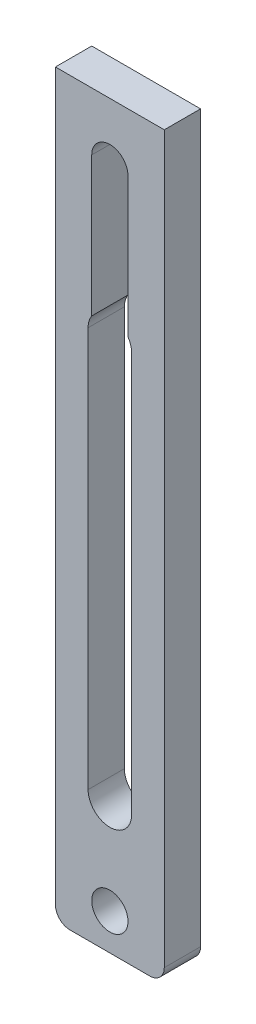
ISO-10303-21;
HEADER;
FILE_DESCRIPTION(('STEP AP214'),'2;1');
FILE_NAME('part.step','',(''),(''),'','','');
FILE_SCHEMA(('AUTOMOTIVE_DESIGN { 1 0 10303 214 1 1 1 1 }'));
ENDSEC;
DATA;
#1=APPLICATION_CONTEXT('core data for automotive mechanical design processes');
#2=APPLICATION_PROTOCOL_DEFINITION('international standard','automotive_design',2000,#1);
#3=PRODUCT_CONTEXT('',#1,'mechanical');
#4=PRODUCT('Part','Part','',(#3));
#5=PRODUCT_RELATED_PRODUCT_CATEGORY('part','',(#4));
#6=PRODUCT_DEFINITION_FORMATION('','',#4);
#7=PRODUCT_DEFINITION_CONTEXT('part definition',#1,'design');
#8=PRODUCT_DEFINITION('design','',#6,#7);
#9=PRODUCT_DEFINITION_SHAPE('','',#8);
#10=(LENGTH_UNIT() NAMED_UNIT(*) SI_UNIT(.MILLI.,.METRE.));
#11=(NAMED_UNIT(*) PLANE_ANGLE_UNIT() SI_UNIT($,.RADIAN.));
#12=(NAMED_UNIT(*) SI_UNIT($,.STERADIAN.) SOLID_ANGLE_UNIT());
#13=UNCERTAINTY_MEASURE_WITH_UNIT(LENGTH_MEASURE(1.E-05),#10,'distance_accuracy_value','');
#14=(GEOMETRIC_REPRESENTATION_CONTEXT(3) GLOBAL_UNCERTAINTY_ASSIGNED_CONTEXT((#13)) GLOBAL_UNIT_ASSIGNED_CONTEXT((#10,
#11,#12)) REPRESENTATION_CONTEXT('',''));
#15=CARTESIAN_POINT('',(0.,0.,0.));
#16=DIRECTION('',(0.,0.,1.));
#17=DIRECTION('',(1.,0.,0.));
#18=AXIS2_PLACEMENT_3D('',#15,#16,#17);
#19=CARTESIAN_POINT('',(-6.985,-62.23,6.35));
#20=DIRECTION('',(0.,0.,-1.));
#21=DIRECTION('',(-1.,0.,0.));
#22=AXIS2_PLACEMENT_3D('',#19,#20,#21);
#23=PLANE('',#22);
#24=DIRECTION('',(0.,1.,0.));
#25=VECTOR('',#24,1.);
#26=CARTESIAN_POINT('',(3.175,-41.91,6.35));
#27=LINE('',#26,#25);
#28=CARTESIAN_POINT('',(3.175,30.2041910980616,6.35));
#29=VERTEX_POINT('',#28);
#30=CARTESIAN_POINT('',(3.175,54.61,6.35));
#31=VERTEX_POINT('',#30);
#32=EDGE_CURVE('E210',#29,#31,#27,.T.);
#33=ORIENTED_EDGE('',*,*,#32,.F.);
#34=CARTESIAN_POINT('',(0.,28.0981343561859,6.35));
#35=DIRECTION('',(0.,0.,1.));
#36=DIRECTION('',(1.,0.,0.));
#37=AXIS2_PLACEMENT_3D('',#34,#35,#36);
#38=CIRCLE('',#37,3.81);
#39=CARTESIAN_POINT('',(3.81,28.0981343561859,6.35));
#40=VERTEX_POINT('',#39);
#41=EDGE_CURVE('E60',#40,#29,#38,.T.);
#42=ORIENTED_EDGE('',*,*,#41,.F.);
#43=DIRECTION('',(0.,1.,0.));
#44=VECTOR('',#43,1.);
#45=CARTESIAN_POINT('',(3.81,28.0981343561859,6.35));
#46=LINE('',#45,#44);
#47=CARTESIAN_POINT('',(3.81000000000001,-41.91,6.35));
#48=VERTEX_POINT('',#47);
#49=EDGE_CURVE('E176',#48,#40,#46,.T.);
#50=ORIENTED_EDGE('',*,*,#49,.F.);
#51=CARTESIAN_POINT('',(0.,-41.91,6.35));
#52=DIRECTION('',(0.,0.,1.));
#53=DIRECTION('',(1.,0.,0.));
#54=AXIS2_PLACEMENT_3D('',#51,#52,#53);
#55=CIRCLE('',#54,3.81);
#56=CARTESIAN_POINT('',(-3.81,-41.91,6.35));
#57=VERTEX_POINT('',#56);
#58=EDGE_CURVE('E183',#57,#48,#55,.T.);
#59=ORIENTED_EDGE('',*,*,#58,.F.);
#60=DIRECTION('',(0.,-1.,0.));
#61=VECTOR('',#60,1.);
#62=CARTESIAN_POINT('',(-3.81,28.0981343561859,6.35));
#63=LINE('',#62,#61);
#64=CARTESIAN_POINT('',(-3.81,28.0981343561859,6.35));
#65=VERTEX_POINT('',#64);
#66=EDGE_CURVE('E193',#65,#57,#63,.T.);
#67=ORIENTED_EDGE('',*,*,#66,.F.);
#68=CARTESIAN_POINT('',(-3.175,30.2041910980616,6.35));
#69=VERTEX_POINT('',#68);
#70=EDGE_CURVE('E153',#69,#65,#38,.T.);
#71=ORIENTED_EDGE('',*,*,#70,.F.);
#72=DIRECTION('',(0.,-1.,0.));
#73=VECTOR('',#72,1.);
#74=CARTESIAN_POINT('',(-3.175,-41.91,6.35));
#75=LINE('',#74,#73);
#76=CARTESIAN_POINT('',(-3.175,54.61,6.35));
#77=VERTEX_POINT('',#76);
#78=EDGE_CURVE('E214',#77,#69,#75,.T.);
#79=ORIENTED_EDGE('',*,*,#78,.F.);
#80=CARTESIAN_POINT('',(0.,54.61,6.35));
#81=DIRECTION('',(0.,0.,1.));
#82=DIRECTION('',(1.,0.,0.));
#83=AXIS2_PLACEMENT_3D('',#80,#81,#82);
#84=CIRCLE('',#83,3.175);
#85=EDGE_CURVE('E222',#31,#77,#84,.T.);
#86=ORIENTED_EDGE('',*,*,#85,.F.);
#87=EDGE_LOOP('',(#33,#42,#50,#59,#67,#71,#79,#86));
#88=FACE_BOUND('',#87,.T.);
#89=DIRECTION('',(0.,1.,0.));
#90=VECTOR('',#89,1.);
#91=CARTESIAN_POINT('',(9.525,-62.23,6.35));
#92=LINE('',#91,#90);
#93=CARTESIAN_POINT('',(9.525,-62.23,6.35));
#94=VERTEX_POINT('',#93);
#95=CARTESIAN_POINT('',(9.525,64.77,6.35));
#96=VERTEX_POINT('',#95);
#97=EDGE_CURVE('E244',#94,#96,#92,.T.);
#98=ORIENTED_EDGE('',*,*,#97,.T.);
#99=DIRECTION('',(-1.,0.,0.));
#100=VECTOR('',#99,1.);
#101=CARTESIAN_POINT('',(-9.525,64.77,6.35));
#102=LINE('',#101,#100);
#103=CARTESIAN_POINT('',(-9.525,64.77,6.35));
#104=VERTEX_POINT('',#103);
#105=EDGE_CURVE('E248',#96,#104,#102,.T.);
#106=ORIENTED_EDGE('',*,*,#105,.T.);
#107=DIRECTION('',(0.,-1.,0.));
#108=VECTOR('',#107,1.);
#109=CARTESIAN_POINT('',(-9.525,-62.23,6.35));
#110=LINE('',#109,#108);
#111=CARTESIAN_POINT('',(-9.525,-62.23,6.35));
#112=VERTEX_POINT('',#111);
#113=EDGE_CURVE('E252',#104,#112,#110,.T.);
#114=ORIENTED_EDGE('',*,*,#113,.T.);
#115=CARTESIAN_POINT('',(-6.985,-62.23,6.35));
#116=DIRECTION('',(0.,0.,1.));
#117=DIRECTION('',(-1.,0.,0.));
#118=AXIS2_PLACEMENT_3D('',#115,#116,#117);
#119=CIRCLE('',#118,2.54);
#120=CARTESIAN_POINT('',(-6.985,-64.77,6.35));
#121=VERTEX_POINT('',#120);
#122=EDGE_CURVE('E255',#112,#121,#119,.T.);
#123=ORIENTED_EDGE('',*,*,#122,.T.);
#124=DIRECTION('',(1.,0.,0.));
#125=VECTOR('',#124,1.);
#126=CARTESIAN_POINT('',(-6.985,-64.77,6.35));
#127=LINE('',#126,#125);
#128=CARTESIAN_POINT('',(6.985,-64.77,6.35));
#129=VERTEX_POINT('',#128);
#130=EDGE_CURVE('E258',#121,#129,#127,.T.);
#131=ORIENTED_EDGE('',*,*,#130,.T.);
#132=CARTESIAN_POINT('',(6.985,-62.23,6.35));
#133=DIRECTION('',(0.,0.,1.));
#134=DIRECTION('',(1.,0.,0.));
#135=AXIS2_PLACEMENT_3D('',#132,#133,#134);
#136=CIRCLE('',#135,2.54);
#137=EDGE_CURVE('E261',#129,#94,#136,.T.);
#138=ORIENTED_EDGE('',*,*,#137,.T.);
#139=EDGE_LOOP('',(#98,#106,#114,#123,#131,#138));
#140=FACE_BOUND('',#139,.T.);
#141=CARTESIAN_POINT('',(0.,-58.42,6.35));
#142=DIRECTION('',(0.,0.,1.));
#143=DIRECTION('',(1.,0.,0.));
#144=AXIS2_PLACEMENT_3D('',#141,#142,#143);
#145=CIRCLE('',#144,3.175);
#146=CARTESIAN_POINT('',(3.175,-58.42,6.35));
#147=VERTEX_POINT('',#146);
#148=EDGE_CURVE('E236',#147,#147,#145,.T.);
#149=ORIENTED_EDGE('',*,*,#148,.F.);
#150=EDGE_LOOP('',(#149));
#151=FACE_BOUND('',#150,.T.);
#152=ADVANCED_FACE('F44',(#88,#140,#151),#23,.F.);
#153=CARTESIAN_POINT('',(-6.985,-62.23,0.));
#154=DIRECTION('',(0.,0.,-1.));
#155=DIRECTION('',(-1.,0.,0.));
#156=AXIS2_PLACEMENT_3D('',#153,#154,#155);
#157=PLANE('',#156);
#158=CARTESIAN_POINT('',(0.,28.0981343561859,0.));
#159=DIRECTION('',(0.,0.,1.));
#160=DIRECTION('',(1.,0.,0.));
#161=AXIS2_PLACEMENT_3D('',#158,#159,#160);
#162=CIRCLE('',#161,3.81);
#163=CARTESIAN_POINT('',(3.81,28.0981343561859,0.));
#164=VERTEX_POINT('',#163);
#165=CARTESIAN_POINT('',(3.175,30.2041910980616,0.));
#166=VERTEX_POINT('',#165);
#167=EDGE_CURVE('E168',#164,#166,#162,.T.);
#168=ORIENTED_EDGE('',*,*,#167,.T.);
#169=DIRECTION('',(0.,1.,0.));
#170=VECTOR('',#169,1.);
#171=CARTESIAN_POINT('',(3.175,-41.91,0.));
#172=LINE('',#171,#170);
#173=CARTESIAN_POINT('',(3.175,54.61,0.));
#174=VERTEX_POINT('',#173);
#175=EDGE_CURVE('E67',#166,#174,#172,.T.);
#176=ORIENTED_EDGE('',*,*,#175,.T.);
#177=CARTESIAN_POINT('',(0.,54.61,0.));
#178=DIRECTION('',(0.,0.,1.));
#179=DIRECTION('',(1.,0.,0.));
#180=AXIS2_PLACEMENT_3D('',#177,#178,#179);
#181=CIRCLE('',#180,3.175);
#182=CARTESIAN_POINT('',(-3.175,54.61,0.));
#183=VERTEX_POINT('',#182);
#184=EDGE_CURVE('E213',#174,#183,#181,.T.);
#185=ORIENTED_EDGE('',*,*,#184,.T.);
#186=DIRECTION('',(0.,-1.,0.));
#187=VECTOR('',#186,1.);
#188=CARTESIAN_POINT('',(-3.175,-41.91,0.));
#189=LINE('',#188,#187);
#190=CARTESIAN_POINT('',(-3.175,30.2041910980616,0.));
#191=VERTEX_POINT('',#190);
#192=EDGE_CURVE('E174',#183,#191,#189,.T.);
#193=ORIENTED_EDGE('',*,*,#192,.T.);
#194=CARTESIAN_POINT('',(-3.81,28.0981343561859,0.));
#195=VERTEX_POINT('',#194);
#196=EDGE_CURVE('E150',#191,#195,#162,.T.);
#197=ORIENTED_EDGE('',*,*,#196,.T.);
#198=DIRECTION('',(0.,-1.,0.));
#199=VECTOR('',#198,1.);
#200=CARTESIAN_POINT('',(-3.81,28.0981343561859,0.));
#201=LINE('',#200,#199);
#202=CARTESIAN_POINT('',(-3.81,-41.91,0.));
#203=VERTEX_POINT('',#202);
#204=EDGE_CURVE('E162',#195,#203,#201,.T.);
#205=ORIENTED_EDGE('',*,*,#204,.T.);
#206=CARTESIAN_POINT('',(0.,-41.91,0.));
#207=DIRECTION('',(0.,0.,1.));
#208=DIRECTION('',(1.,0.,0.));
#209=AXIS2_PLACEMENT_3D('',#206,#207,#208);
#210=CIRCLE('',#209,3.81);
#211=CARTESIAN_POINT('',(3.81000000000001,-41.91,0.));
#212=VERTEX_POINT('',#211);
#213=EDGE_CURVE('E167',#203,#212,#210,.T.);
#214=ORIENTED_EDGE('',*,*,#213,.T.);
#215=DIRECTION('',(0.,1.,0.));
#216=VECTOR('',#215,1.);
#217=CARTESIAN_POINT('',(3.81,28.0981343561859,0.));
#218=LINE('',#217,#216);
#219=EDGE_CURVE('E159',#212,#164,#218,.T.);
#220=ORIENTED_EDGE('',*,*,#219,.T.);
#221=EDGE_LOOP('',(#168,#176,#185,#193,#197,#205,#214,#220));
#222=FACE_BOUND('',#221,.T.);
#223=DIRECTION('',(0.,1.,0.));
#224=VECTOR('',#223,1.);
#225=CARTESIAN_POINT('',(9.525,-62.23,0.));
#226=LINE('',#225,#224);
#227=CARTESIAN_POINT('',(9.525,-62.23,0.));
#228=VERTEX_POINT('',#227);
#229=CARTESIAN_POINT('',(9.525,64.77,0.));
#230=VERTEX_POINT('',#229);
#231=EDGE_CURVE('E240',#228,#230,#226,.T.);
#232=ORIENTED_EDGE('',*,*,#231,.F.);
#233=CARTESIAN_POINT('',(6.985,-62.23,0.));
#234=DIRECTION('',(0.,0.,1.));
#235=DIRECTION('',(1.,0.,0.));
#236=AXIS2_PLACEMENT_3D('',#233,#234,#235);
#237=CIRCLE('',#236,2.54);
#238=CARTESIAN_POINT('',(6.985,-64.77,0.));
#239=VERTEX_POINT('',#238);
#240=EDGE_CURVE('E249',#239,#228,#237,.T.);
#241=ORIENTED_EDGE('',*,*,#240,.F.);
#242=DIRECTION('',(1.,0.,0.));
#243=VECTOR('',#242,1.);
#244=CARTESIAN_POINT('',(-6.985,-64.77,0.));
#245=LINE('',#244,#243);
#246=CARTESIAN_POINT('',(-6.985,-64.77,0.));
#247=VERTEX_POINT('',#246);
#248=EDGE_CURVE('E277',#247,#239,#245,.T.);
#249=ORIENTED_EDGE('',*,*,#248,.F.);
#250=CARTESIAN_POINT('',(-6.985,-62.23,0.));
#251=DIRECTION('',(0.,0.,1.));
#252=DIRECTION('',(-1.,0.,0.));
#253=AXIS2_PLACEMENT_3D('',#250,#251,#252);
#254=CIRCLE('',#253,2.54);
#255=CARTESIAN_POINT('',(-9.525,-62.23,0.));
#256=VERTEX_POINT('',#255);
#257=EDGE_CURVE('E274',#256,#247,#254,.T.);
#258=ORIENTED_EDGE('',*,*,#257,.F.);
#259=DIRECTION('',(0.,-1.,0.));
#260=VECTOR('',#259,1.);
#261=CARTESIAN_POINT('',(-9.525,-62.23,0.));
#262=LINE('',#261,#260);
#263=CARTESIAN_POINT('',(-9.525,64.77,0.));
#264=VERTEX_POINT('',#263);
#265=EDGE_CURVE('E271',#264,#256,#262,.T.);
#266=ORIENTED_EDGE('',*,*,#265,.F.);
#267=DIRECTION('',(-1.,0.,0.));
#268=VECTOR('',#267,1.);
#269=CARTESIAN_POINT('',(-9.525,64.77,0.));
#270=LINE('',#269,#268);
#271=EDGE_CURVE('E268',#230,#264,#270,.T.);
#272=ORIENTED_EDGE('',*,*,#271,.F.);
#273=EDGE_LOOP('',(#232,#241,#249,#258,#266,#272));
#274=FACE_BOUND('',#273,.T.);
#275=CARTESIAN_POINT('',(0.,-58.42,0.));
#276=DIRECTION('',(0.,0.,1.));
#277=DIRECTION('',(1.,0.,0.));
#278=AXIS2_PLACEMENT_3D('',#275,#276,#277);
#279=CIRCLE('',#278,3.175);
#280=CARTESIAN_POINT('',(3.175,-58.42,0.));
#281=VERTEX_POINT('',#280);
#282=EDGE_CURVE('E232',#281,#281,#279,.T.);
#283=ORIENTED_EDGE('',*,*,#282,.T.);
#284=EDGE_LOOP('',(#283));
#285=FACE_BOUND('',#284,.T.);
#286=ADVANCED_FACE('F171',(#222,#274,#285),#157,.T.);
#287=CARTESIAN_POINT('',(9.525,-62.23,6.35));
#288=DIRECTION('',(-1.,0.,0.));
#289=DIRECTION('',(0.,0.,1.));
#290=AXIS2_PLACEMENT_3D('',#287,#288,#289);
#291=PLANE('',#290);
#292=ORIENTED_EDGE('',*,*,#231,.T.);
#293=DIRECTION('',(0.,0.,-1.));
#294=VECTOR('',#293,1.);
#295=CARTESIAN_POINT('',(9.525,64.77,6.35));
#296=LINE('',#295,#294);
#297=EDGE_CURVE('E53',#96,#230,#296,.T.);
#298=ORIENTED_EDGE('',*,*,#297,.F.);
#299=ORIENTED_EDGE('',*,*,#97,.F.);
#300=DIRECTION('',(0.,0.,-1.));
#301=VECTOR('',#300,1.);
#302=CARTESIAN_POINT('',(9.525,-62.23,6.35));
#303=LINE('',#302,#301);
#304=EDGE_CURVE('E264',#94,#228,#303,.T.);
#305=ORIENTED_EDGE('',*,*,#304,.T.);
#306=EDGE_LOOP('',(#292,#298,#299,#305));
#307=FACE_BOUND('',#306,.T.);
#308=ADVANCED_FACE('F46',(#307),#291,.F.);
#309=CARTESIAN_POINT('',(-9.525,64.77,6.35));
#310=DIRECTION('',(0.,-1.,0.));
#311=DIRECTION('',(0.,0.,-1.));
#312=AXIS2_PLACEMENT_3D('',#309,#310,#311);
#313=PLANE('',#312);
#314=ORIENTED_EDGE('',*,*,#271,.T.);
#315=DIRECTION('',(0.,0.,-1.));
#316=VECTOR('',#315,1.);
#317=CARTESIAN_POINT('',(-9.525,64.77,6.35));
#318=LINE('',#317,#316);
#319=EDGE_CURVE('E297',#104,#264,#318,.T.);
#320=ORIENTED_EDGE('',*,*,#319,.F.);
#321=ORIENTED_EDGE('',*,*,#105,.F.);
#322=ORIENTED_EDGE('',*,*,#297,.T.);
#323=EDGE_LOOP('',(#314,#320,#321,#322));
#324=FACE_BOUND('',#323,.T.);
#325=ADVANCED_FACE('F306',(#324),#313,.F.);
#326=CARTESIAN_POINT('',(-9.525,-62.23,6.35));
#327=DIRECTION('',(1.,0.,0.));
#328=DIRECTION('',(0.,0.,-1.));
#329=AXIS2_PLACEMENT_3D('',#326,#327,#328);
#330=PLANE('',#329);
#331=ORIENTED_EDGE('',*,*,#265,.T.);
#332=DIRECTION('',(0.,0.,-1.));
#333=VECTOR('',#332,1.);
#334=CARTESIAN_POINT('',(-9.525,-62.23,6.35));
#335=LINE('',#334,#333);
#336=EDGE_CURVE('E293',#112,#256,#335,.T.);
#337=ORIENTED_EDGE('',*,*,#336,.F.);
#338=ORIENTED_EDGE('',*,*,#113,.F.);
#339=ORIENTED_EDGE('',*,*,#319,.T.);
#340=EDGE_LOOP('',(#331,#337,#338,#339));
#341=FACE_BOUND('',#340,.T.);
#342=ADVANCED_FACE('F319',(#341),#330,.F.);
#343=CARTESIAN_POINT('',(-6.985,-62.23,6.35));
#344=DIRECTION('',(0.,0.,-1.));
#345=DIRECTION('',(-1.,0.,0.));
#346=AXIS2_PLACEMENT_3D('',#343,#344,#345);
#347=CYLINDRICAL_SURFACE('',#346,2.54);
#348=ORIENTED_EDGE('',*,*,#257,.T.);
#349=DIRECTION('',(0.,0.,-1.));
#350=VECTOR('',#349,1.);
#351=CARTESIAN_POINT('',(-6.985,-64.77,6.35));
#352=LINE('',#351,#350);
#353=EDGE_CURVE('E289',#121,#247,#352,.T.);
#354=ORIENTED_EDGE('',*,*,#353,.F.);
#355=ORIENTED_EDGE('',*,*,#122,.F.);
#356=ORIENTED_EDGE('',*,*,#336,.T.);
#357=EDGE_LOOP('',(#348,#354,#355,#356));
#358=FACE_BOUND('',#357,.T.);
#359=ADVANCED_FACE('F323',(#358),#347,.T.);
#360=CARTESIAN_POINT('',(-6.985,-64.77,6.35));
#361=DIRECTION('',(0.,1.,0.));
#362=DIRECTION('',(0.,0.,1.));
#363=AXIS2_PLACEMENT_3D('',#360,#361,#362);
#364=PLANE('',#363);
#365=ORIENTED_EDGE('',*,*,#248,.T.);
#366=DIRECTION('',(0.,0.,-1.));
#367=VECTOR('',#366,1.);
#368=CARTESIAN_POINT('',(6.985,-64.77,6.35));
#369=LINE('',#368,#367);
#370=EDGE_CURVE('E285',#129,#239,#369,.T.);
#371=ORIENTED_EDGE('',*,*,#370,.F.);
#372=ORIENTED_EDGE('',*,*,#130,.F.);
#373=ORIENTED_EDGE('',*,*,#353,.T.);
#374=EDGE_LOOP('',(#365,#371,#372,#373));
#375=FACE_BOUND('',#374,.T.);
#376=ADVANCED_FACE('F333',(#375),#364,.F.);
#377=CARTESIAN_POINT('',(6.985,-62.23,6.35));
#378=DIRECTION('',(0.,0.,-1.));
#379=DIRECTION('',(-1.,0.,0.));
#380=AXIS2_PLACEMENT_3D('',#377,#378,#379);
#381=CYLINDRICAL_SURFACE('',#380,2.54);
#382=ORIENTED_EDGE('',*,*,#240,.T.);
#383=ORIENTED_EDGE('',*,*,#304,.F.);
#384=ORIENTED_EDGE('',*,*,#137,.F.);
#385=ORIENTED_EDGE('',*,*,#370,.T.);
#386=EDGE_LOOP('',(#382,#383,#384,#385));
#387=FACE_BOUND('',#386,.T.);
#388=ADVANCED_FACE('F331',(#387),#381,.T.);
#389=CARTESIAN_POINT('',(0.,-58.42,6.35));
#390=DIRECTION('',(0.,0.,-1.));
#391=DIRECTION('',(-1.,0.,0.));
#392=AXIS2_PLACEMENT_3D('',#389,#390,#391);
#393=CYLINDRICAL_SURFACE('',#392,3.175);
#394=ORIENTED_EDGE('',*,*,#148,.T.);
#395=EDGE_LOOP('',(#394));
#396=FACE_BOUND('',#395,.T.);
#397=ORIENTED_EDGE('',*,*,#282,.F.);
#398=EDGE_LOOP('',(#397));
#399=FACE_BOUND('',#398,.T.);
#400=ADVANCED_FACE('F340',(#396,#399),#393,.F.);
#401=CARTESIAN_POINT('',(-3.175,-41.91,0.));
#402=DIRECTION('',(-1.,0.,0.));
#403=DIRECTION('',(0.,0.,1.));
#404=AXIS2_PLACEMENT_3D('',#401,#402,#403);
#405=PLANE('',#404);
#406=ORIENTED_EDGE('',*,*,#78,.T.);
#407=DIRECTION('',(0.,0.,1.));
#408=VECTOR('',#407,1.);
#409=CARTESIAN_POINT('',(-3.175,30.2041910980616,0.));
#410=LINE('',#409,#408);
#411=EDGE_CURVE('E202',#69,#191,#410,.F.);
#412=ORIENTED_EDGE('',*,*,#411,.T.);
#413=ORIENTED_EDGE('',*,*,#192,.F.);
#414=DIRECTION('',(0.,0.,1.));
#415=VECTOR('',#414,1.);
#416=CARTESIAN_POINT('',(-3.175,54.61,0.));
#417=LINE('',#416,#415);
#418=EDGE_CURVE('E229',#183,#77,#417,.T.);
#419=ORIENTED_EDGE('',*,*,#418,.T.);
#420=EDGE_LOOP('',(#406,#412,#413,#419));
#421=FACE_BOUND('',#420,.T.);
#422=ADVANCED_FACE('F355',(#421),#405,.F.);
#423=CARTESIAN_POINT('',(0.,54.61,0.));
#424=DIRECTION('',(0.,0.,1.));
#425=DIRECTION('',(1.,0.,0.));
#426=AXIS2_PLACEMENT_3D('',#423,#424,#425);
#427=CYLINDRICAL_SURFACE('',#426,3.175);
#428=ORIENTED_EDGE('',*,*,#85,.T.);
#429=ORIENTED_EDGE('',*,*,#418,.F.);
#430=ORIENTED_EDGE('',*,*,#184,.F.);
#431=DIRECTION('',(0.,0.,1.));
#432=VECTOR('',#431,1.);
#433=CARTESIAN_POINT('',(3.175,54.61,0.));
#434=LINE('',#433,#432);
#435=EDGE_CURVE('E219',#174,#31,#434,.T.);
#436=ORIENTED_EDGE('',*,*,#435,.T.);
#437=EDGE_LOOP('',(#428,#429,#430,#436));
#438=FACE_BOUND('',#437,.T.);
#439=ADVANCED_FACE('F360',(#438),#427,.F.);
#440=CARTESIAN_POINT('',(3.175,-41.91,0.));
#441=DIRECTION('',(1.,0.,0.));
#442=DIRECTION('',(0.,0.,-1.));
#443=AXIS2_PLACEMENT_3D('',#440,#441,#442);
#444=PLANE('',#443);
#445=ORIENTED_EDGE('',*,*,#175,.F.);
#446=DIRECTION('',(0.,0.,1.));
#447=VECTOR('',#446,1.);
#448=CARTESIAN_POINT('',(3.175,30.2041910980616,0.));
#449=LINE('',#448,#447);
#450=EDGE_CURVE('E11',#166,#29,#449,.T.);
#451=ORIENTED_EDGE('',*,*,#450,.T.);
#452=ORIENTED_EDGE('',*,*,#32,.T.);
#453=ORIENTED_EDGE('',*,*,#435,.F.);
#454=EDGE_LOOP('',(#445,#451,#452,#453));
#455=FACE_BOUND('',#454,.T.);
#456=ADVANCED_FACE('F357',(#455),#444,.F.);
#457=CARTESIAN_POINT('',(0.,28.0981343561859,0.));
#458=DIRECTION('',(0.,0.,1.));
#459=DIRECTION('',(1.,0.,0.));
#460=AXIS2_PLACEMENT_3D('',#457,#458,#459);
#461=CYLINDRICAL_SURFACE('',#460,3.81);
#462=ORIENTED_EDGE('',*,*,#70,.T.);
#463=DIRECTION('',(0.,0.,1.));
#464=VECTOR('',#463,1.);
#465=CARTESIAN_POINT('',(-3.81,28.0981343561859,0.));
#466=LINE('',#465,#464);
#467=EDGE_CURVE('E146',#195,#65,#466,.T.);
#468=ORIENTED_EDGE('',*,*,#467,.F.);
#469=ORIENTED_EDGE('',*,*,#196,.F.);
#470=ORIENTED_EDGE('',*,*,#411,.F.);
#471=EDGE_LOOP('',(#462,#468,#469,#470));
#472=FACE_BOUND('',#471,.T.);
#473=ADVANCED_FACE('F148',(#472),#461,.F.);
#474=ORIENTED_EDGE('',*,*,#167,.F.);
#475=DIRECTION('',(0.,0.,1.));
#476=VECTOR('',#475,1.);
#477=CARTESIAN_POINT('',(3.81,28.0981343561859,0.));
#478=LINE('',#477,#476);
#479=EDGE_CURVE('E199',#164,#40,#478,.T.);
#480=ORIENTED_EDGE('',*,*,#479,.T.);
#481=ORIENTED_EDGE('',*,*,#41,.T.);
#482=ORIENTED_EDGE('',*,*,#450,.F.);
#483=EDGE_LOOP('',(#474,#480,#481,#482));
#484=FACE_BOUND('',#483,.T.);
#485=ADVANCED_FACE('F370',(#484),#461,.F.);
#486=CARTESIAN_POINT('',(3.81,28.0981343561859,0.));
#487=DIRECTION('',(1.,0.,0.));
#488=DIRECTION('',(0.,1.,0.));
#489=AXIS2_PLACEMENT_3D('',#486,#487,#488);
#490=PLANE('',#489);
#491=ORIENTED_EDGE('',*,*,#49,.T.);
#492=ORIENTED_EDGE('',*,*,#479,.F.);
#493=ORIENTED_EDGE('',*,*,#219,.F.);
#494=DIRECTION('',(0.,0.,1.));
#495=VECTOR('',#494,1.);
#496=CARTESIAN_POINT('',(3.81000000000001,-41.91,0.));
#497=LINE('',#496,#495);
#498=EDGE_CURVE('E203',#212,#48,#497,.T.);
#499=ORIENTED_EDGE('',*,*,#498,.T.);
#500=EDGE_LOOP('',(#491,#492,#493,#499));
#501=FACE_BOUND('',#500,.T.);
#502=ADVANCED_FACE('F376',(#501),#490,.F.);
#503=CARTESIAN_POINT('',(0.,-41.91,0.));
#504=DIRECTION('',(0.,0.,1.));
#505=DIRECTION('',(1.,0.,0.));
#506=AXIS2_PLACEMENT_3D('',#503,#504,#505);
#507=CYLINDRICAL_SURFACE('',#506,3.81);
#508=ORIENTED_EDGE('',*,*,#58,.T.);
#509=ORIENTED_EDGE('',*,*,#498,.F.);
#510=ORIENTED_EDGE('',*,*,#213,.F.);
#511=DIRECTION('',(0.,0.,1.));
#512=VECTOR('',#511,1.);
#513=CARTESIAN_POINT('',(-3.81,-41.91,0.));
#514=LINE('',#513,#512);
#515=EDGE_CURVE('E158',#203,#57,#514,.T.);
#516=ORIENTED_EDGE('',*,*,#515,.T.);
#517=EDGE_LOOP('',(#508,#509,#510,#516));
#518=FACE_BOUND('',#517,.T.);
#519=ADVANCED_FACE('F373',(#518),#507,.F.);
#520=CARTESIAN_POINT('',(-3.81,28.0981343561859,0.));
#521=DIRECTION('',(-1.,0.,0.));
#522=DIRECTION('',(0.,-1.,0.));
#523=AXIS2_PLACEMENT_3D('',#520,#521,#522);
#524=PLANE('',#523);
#525=ORIENTED_EDGE('',*,*,#66,.T.);
#526=ORIENTED_EDGE('',*,*,#515,.F.);
#527=ORIENTED_EDGE('',*,*,#204,.F.);
#528=ORIENTED_EDGE('',*,*,#467,.T.);
#529=EDGE_LOOP('',(#525,#526,#527,#528));
#530=FACE_BOUND('',#529,.T.);
#531=ADVANCED_FACE('F163',(#530),#524,.F.);
#532=CLOSED_SHELL('',(#152,#286,#308,#325,#342,#359,#376,#388,#400,#422,#439,#456,#473,#485,
#502,#519,#531));
#533=MANIFOLD_SOLID_BREP('B2',#532);
#534=ADVANCED_BREP_SHAPE_REPRESENTATION('',(#18,#533),#14);
#535=SHAPE_DEFINITION_REPRESENTATION(#9,#534);
ENDSEC;
END-ISO-10303-21;
